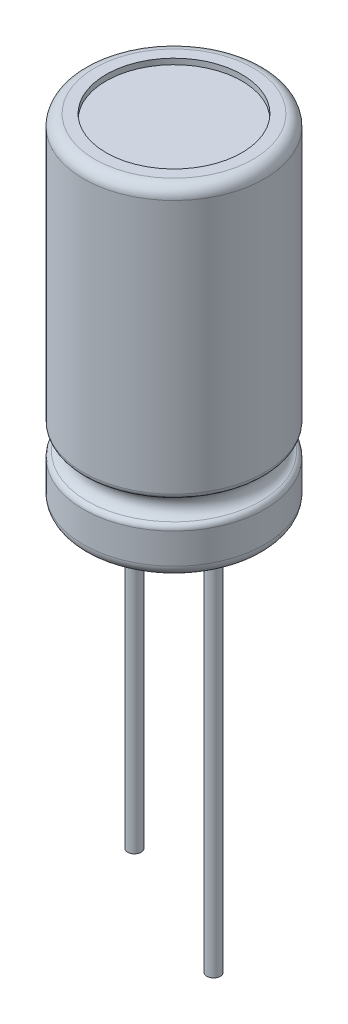
ISO-10303-21;
HEADER;
FILE_DESCRIPTION(('STEP AP214'),'2;1');
FILE_NAME('part.step','',(''),(''),'','','');
FILE_SCHEMA(('AUTOMOTIVE_DESIGN { 1 0 10303 214 1 1 1 1 }'));
ENDSEC;
DATA;
#1=APPLICATION_CONTEXT('core data for automotive mechanical design processes');
#2=APPLICATION_PROTOCOL_DEFINITION('international standard','automotive_design',2000,#1);
#3=PRODUCT_CONTEXT('',#1,'mechanical');
#4=PRODUCT('Part','Part','',(#3));
#5=PRODUCT_RELATED_PRODUCT_CATEGORY('part','',(#4));
#6=PRODUCT_DEFINITION_FORMATION('','',#4);
#7=PRODUCT_DEFINITION_CONTEXT('part definition',#1,'design');
#8=PRODUCT_DEFINITION('design','',#6,#7);
#9=PRODUCT_DEFINITION_SHAPE('','',#8);
#10=(LENGTH_UNIT() NAMED_UNIT(*) SI_UNIT(.MILLI.,.METRE.));
#11=(NAMED_UNIT(*) PLANE_ANGLE_UNIT() SI_UNIT($,.RADIAN.));
#12=(NAMED_UNIT(*) SI_UNIT($,.STERADIAN.) SOLID_ANGLE_UNIT());
#13=UNCERTAINTY_MEASURE_WITH_UNIT(LENGTH_MEASURE(1.E-05),#10,'distance_accuracy_value','');
#14=(GEOMETRIC_REPRESENTATION_CONTEXT(3) GLOBAL_UNCERTAINTY_ASSIGNED_CONTEXT((#13)) GLOBAL_UNIT_ASSIGNED_CONTEXT((#10,
#11,#12)) REPRESENTATION_CONTEXT('',''));
#15=CARTESIAN_POINT('',(0.,0.,0.));
#16=DIRECTION('',(0.,0.,1.));
#17=DIRECTION('',(1.,0.,0.));
#18=AXIS2_PLACEMENT_3D('',#15,#16,#17);
#19=CARTESIAN_POINT('',(-1.75,-17.,0.));
#20=DIRECTION('',(0.,1.,0.));
#21=DIRECTION('',(0.,0.,1.));
#22=AXIS2_PLACEMENT_3D('',#19,#20,#21);
#23=CYLINDRICAL_SURFACE('',#22,0.3);
#24=CARTESIAN_POINT('',(-1.75,0.25,0.));
#25=DIRECTION('',(0.,-1.,0.));
#26=DIRECTION('',(0.,0.,-1.));
#27=AXIS2_PLACEMENT_3D('',#24,#25,#26);
#28=CIRCLE('',#27,0.3);
#29=CARTESIAN_POINT('',(-1.75,0.25,-0.3));
#30=VERTEX_POINT('',#29);
#31=EDGE_CURVE('E65',#30,#30,#28,.T.);
#32=ORIENTED_EDGE('',*,*,#31,.T.);
#33=EDGE_LOOP('',(#32));
#34=FACE_BOUND('',#33,.T.);
#35=CARTESIAN_POINT('',(-1.75,-14.,0.));
#36=DIRECTION('',(0.,-1.,0.));
#37=DIRECTION('',(0.,0.,-1.));
#38=AXIS2_PLACEMENT_3D('',#35,#36,#37);
#39=CIRCLE('',#38,0.3);
#40=CARTESIAN_POINT('',(-1.75,-14.,-0.3));
#41=VERTEX_POINT('',#40);
#42=EDGE_CURVE('E74',#41,#41,#39,.T.);
#43=ORIENTED_EDGE('',*,*,#42,.F.);
#44=EDGE_LOOP('',(#43));
#45=FACE_BOUND('',#44,.T.);
#46=ADVANCED_FACE('F29',(#34,#45),#23,.T.);
#47=CARTESIAN_POINT('',(0.,0.25,0.));
#48=DIRECTION('',(0.,-1.,0.));
#49=DIRECTION('',(0.,0.,-1.));
#50=AXIS2_PLACEMENT_3D('',#47,#48,#49);
#51=PLANE('',#50);
#52=ORIENTED_EDGE('',*,*,#31,.F.);
#53=EDGE_LOOP('',(#52));
#54=FACE_BOUND('',#53,.T.);
#55=CARTESIAN_POINT('',(0.,0.25,0.));
#56=DIRECTION('',(0.,-1.,0.));
#57=DIRECTION('',(0.,0.,-1.));
#58=AXIS2_PLACEMENT_3D('',#55,#56,#57);
#59=CIRCLE('',#58,3.);
#60=CARTESIAN_POINT('',(0.,0.25,-3.));
#61=VERTEX_POINT('',#60);
#62=EDGE_CURVE('E61',#61,#61,#59,.T.);
#63=ORIENTED_EDGE('',*,*,#62,.T.);
#64=EDGE_LOOP('',(#63));
#65=FACE_BOUND('',#64,.T.);
#66=CARTESIAN_POINT('',(1.75,0.25,0.));
#67=DIRECTION('',(0.,-1.,0.));
#68=DIRECTION('',(0.,0.,-1.));
#69=AXIS2_PLACEMENT_3D('',#66,#67,#68);
#70=CIRCLE('',#69,0.3);
#71=CARTESIAN_POINT('',(1.75,0.25,-0.3));
#72=VERTEX_POINT('',#71);
#73=EDGE_CURVE('E71',#72,#72,#70,.T.);
#74=ORIENTED_EDGE('',*,*,#73,.F.);
#75=EDGE_LOOP('',(#74));
#76=FACE_BOUND('',#75,.T.);
#77=ADVANCED_FACE('F118',(#54,#65,#76),#51,.T.);
#78=CARTESIAN_POINT('',(0.,15.,0.));
#79=DIRECTION('',(0.,-1.,0.));
#80=DIRECTION('',(0.,0.,-1.));
#81=AXIS2_PLACEMENT_3D('',#78,#79,#80);
#82=CYLINDRICAL_SURFACE('',#81,4.);
#83=CARTESIAN_POINT('',(0.,1.84607916782785,0.));
#84=DIRECTION('',(0.,1.,0.));
#85=DIRECTION('',(0.,0.,1.));
#86=AXIS2_PLACEMENT_3D('',#83,#84,#85);
#87=CIRCLE('',#86,4.);
#88=CARTESIAN_POINT('',(0.,1.84607916782785,4.));
#89=VERTEX_POINT('',#88);
#90=EDGE_CURVE('E44',#89,#89,#87,.F.);
#91=ORIENTED_EDGE('',*,*,#90,.T.);
#92=EDGE_LOOP('',(#91));
#93=FACE_BOUND('',#92,.T.);
#94=CARTESIAN_POINT('',(0.,0.5,0.));
#95=DIRECTION('',(0.,1.,0.));
#96=DIRECTION('',(0.,0.,1.));
#97=AXIS2_PLACEMENT_3D('',#94,#95,#96);
#98=CIRCLE('',#97,4.);
#99=CARTESIAN_POINT('',(0.,0.5,4.));
#100=VERTEX_POINT('',#99);
#101=EDGE_CURVE('E58',#100,#100,#98,.T.);
#102=ORIENTED_EDGE('',*,*,#101,.T.);
#103=EDGE_LOOP('',(#102));
#104=FACE_BOUND('',#103,.T.);
#105=ADVANCED_FACE('F124',(#93,#104),#82,.T.);
#106=CARTESIAN_POINT('',(0.,0.,0.));
#107=DIRECTION('',(0.,1.,0.));
#108=DIRECTION('',(0.,0.,1.));
#109=AXIS2_PLACEMENT_3D('',#106,#107,#108);
#110=PLANE('',#109);
#111=CARTESIAN_POINT('',(0.,0.,0.));
#112=DIRECTION('',(0.,-1.,0.));
#113=DIRECTION('',(0.,0.,-1.));
#114=AXIS2_PLACEMENT_3D('',#111,#112,#113);
#115=CIRCLE('',#114,3.);
#116=CARTESIAN_POINT('',(0.,0.,-3.));
#117=VERTEX_POINT('',#116);
#118=EDGE_CURVE('E62',#117,#117,#115,.T.);
#119=ORIENTED_EDGE('',*,*,#118,.F.);
#120=EDGE_LOOP('',(#119));
#121=FACE_BOUND('',#120,.T.);
#122=CARTESIAN_POINT('',(0.,0.,0.));
#123=DIRECTION('',(0.,1.,0.));
#124=DIRECTION('',(0.,0.,1.));
#125=AXIS2_PLACEMENT_3D('',#122,#123,#124);
#126=CIRCLE('',#125,3.5);
#127=CARTESIAN_POINT('',(0.,0.,3.5));
#128=VERTEX_POINT('',#127);
#129=EDGE_CURVE('E55',#128,#128,#126,.F.);
#130=ORIENTED_EDGE('',*,*,#129,.T.);
#131=EDGE_LOOP('',(#130));
#132=FACE_BOUND('',#131,.T.);
#133=ADVANCED_FACE('F137',(#121,#132),#110,.F.);
#134=CARTESIAN_POINT('',(0.,2.5531859490144,0.));
#135=DIRECTION('',(0.,-1.,0.));
#136=DIRECTION('',(0.,0.,-1.));
#137=AXIS2_PLACEMENT_3D('',#134,#135,#136);
#138=TOROIDAL_SURFACE('',#137,4.,0.5);
#139=CARTESIAN_POINT('',(0.,2.08178142822341,0.));
#140=DIRECTION('',(0.,1.,0.));
#141=DIRECTION('',(0.,0.,1.));
#142=AXIS2_PLACEMENT_3D('',#139,#140,#141);
#143=CIRCLE('',#142,3.83333333333335);
#144=CARTESIAN_POINT('',(0.,2.08178142822341,3.83333333333335));
#145=VERTEX_POINT('',#144);
#146=EDGE_CURVE('E36',#145,#145,#143,.T.);
#147=ORIENTED_EDGE('',*,*,#146,.T.);
#148=EDGE_LOOP('',(#147));
#149=FACE_BOUND('',#148,.T.);
#150=CARTESIAN_POINT('',(0.,3.02459046980538,0.));
#151=DIRECTION('',(0.,-1.,0.));
#152=DIRECTION('',(0.,0.,-1.));
#153=AXIS2_PLACEMENT_3D('',#150,#151,#152);
#154=CIRCLE('',#153,3.83333333333335);
#155=CARTESIAN_POINT('',(0.,3.02459046980538,-3.83333333333335));
#156=VERTEX_POINT('',#155);
#157=EDGE_CURVE('E40',#156,#156,#154,.T.);
#158=ORIENTED_EDGE('',*,*,#157,.T.);
#159=EDGE_LOOP('',(#158));
#160=FACE_BOUND('',#159,.T.);
#161=ADVANCED_FACE('F99',(#149,#160),#138,.F.);
#162=CARTESIAN_POINT('',(0.,15.,0.));
#163=DIRECTION('',(0.,1.,0.));
#164=DIRECTION('',(0.,0.,1.));
#165=AXIS2_PLACEMENT_3D('',#162,#163,#164);
#166=PLANE('',#165);
#167=CARTESIAN_POINT('',(0.,15.,0.));
#168=DIRECTION('',(0.,1.,0.));
#169=DIRECTION('',(0.,0.,1.));
#170=AXIS2_PLACEMENT_3D('',#167,#168,#169);
#171=CIRCLE('',#170,3.);
#172=CARTESIAN_POINT('',(0.,15.,3.));
#173=VERTEX_POINT('',#172);
#174=EDGE_CURVE('E80',#173,#173,#171,.T.);
#175=ORIENTED_EDGE('',*,*,#174,.F.);
#176=EDGE_LOOP('',(#175));
#177=FACE_BOUND('',#176,.T.);
#178=CARTESIAN_POINT('',(0.,15.,0.));
#179=DIRECTION('',(0.,1.,0.));
#180=DIRECTION('',(0.,0.,1.));
#181=AXIS2_PLACEMENT_3D('',#178,#179,#180);
#182=CIRCLE('',#181,3.5);
#183=CARTESIAN_POINT('',(0.,15.,3.5));
#184=VERTEX_POINT('',#183);
#185=EDGE_CURVE('E52',#184,#184,#182,.T.);
#186=ORIENTED_EDGE('',*,*,#185,.T.);
#187=EDGE_LOOP('',(#186));
#188=FACE_BOUND('',#187,.T.);
#189=ADVANCED_FACE('F95',(#177,#188),#166,.T.);
#190=CARTESIAN_POINT('',(0.,3.26029273020095,0.));
#191=DIRECTION('',(0.,1.,0.));
#192=DIRECTION('',(0.,0.,1.));
#193=AXIS2_PLACEMENT_3D('',#190,#191,#192);
#194=CIRCLE('',#193,4.);
#195=CARTESIAN_POINT('',(0.,3.26029273020095,4.));
#196=VERTEX_POINT('',#195);
#197=EDGE_CURVE('E10',#196,#196,#194,.T.);
#198=ORIENTED_EDGE('',*,*,#197,.T.);
#199=EDGE_LOOP('',(#198));
#200=FACE_BOUND('',#199,.T.);
#201=CARTESIAN_POINT('',(0.,14.5,0.));
#202=DIRECTION('',(0.,1.,0.));
#203=DIRECTION('',(0.,0.,1.));
#204=AXIS2_PLACEMENT_3D('',#201,#202,#203);
#205=CIRCLE('',#204,4.);
#206=CARTESIAN_POINT('',(0.,14.5,4.));
#207=VERTEX_POINT('',#206);
#208=EDGE_CURVE('E49',#207,#207,#205,.F.);
#209=ORIENTED_EDGE('',*,*,#208,.T.);
#210=EDGE_LOOP('',(#209));
#211=FACE_BOUND('',#210,.T.);
#212=ADVANCED_FACE('F98',(#200,#211),#82,.T.);
#213=CARTESIAN_POINT('',(0.,0.5,0.));
#214=DIRECTION('',(0.,1.,0.));
#215=DIRECTION('',(0.,0.,1.));
#216=AXIS2_PLACEMENT_3D('',#213,#214,#215);
#217=TOROIDAL_SURFACE('',#216,3.5,0.5);
#218=ORIENTED_EDGE('',*,*,#129,.F.);
#219=EDGE_LOOP('',(#218));
#220=FACE_BOUND('',#219,.T.);
#221=ORIENTED_EDGE('',*,*,#101,.F.);
#222=EDGE_LOOP('',(#221));
#223=FACE_BOUND('',#222,.T.);
#224=ADVANCED_FACE('F106',(#220,#223),#217,.T.);
#225=CARTESIAN_POINT('',(0.,14.5,0.));
#226=DIRECTION('',(0.,1.,0.));
#227=DIRECTION('',(0.,0.,1.));
#228=AXIS2_PLACEMENT_3D('',#225,#226,#227);
#229=TOROIDAL_SURFACE('',#228,3.5,0.5);
#230=ORIENTED_EDGE('',*,*,#208,.F.);
#231=EDGE_LOOP('',(#230));
#232=FACE_BOUND('',#231,.T.);
#233=ORIENTED_EDGE('',*,*,#185,.F.);
#234=EDGE_LOOP('',(#233));
#235=FACE_BOUND('',#234,.T.);
#236=ADVANCED_FACE('F103',(#232,#235),#229,.T.);
#237=CARTESIAN_POINT('',(0.,1.84607916782785,0.));
#238=DIRECTION('',(0.,1.,0.));
#239=DIRECTION('',(0.,0.,1.));
#240=AXIS2_PLACEMENT_3D('',#237,#238,#239);
#241=TOROIDAL_SURFACE('',#240,3.75,0.25);
#242=ORIENTED_EDGE('',*,*,#146,.F.);
#243=EDGE_LOOP('',(#242));
#244=FACE_BOUND('',#243,.T.);
#245=ORIENTED_EDGE('',*,*,#90,.F.);
#246=EDGE_LOOP('',(#245));
#247=FACE_BOUND('',#246,.T.);
#248=ADVANCED_FACE('F105',(#244,#247),#241,.T.);
#249=CARTESIAN_POINT('',(0.,3.26029273020095,0.));
#250=DIRECTION('',(0.,1.,0.));
#251=DIRECTION('',(0.,0.,1.));
#252=AXIS2_PLACEMENT_3D('',#249,#250,#251);
#253=TOROIDAL_SURFACE('',#252,3.75,0.25);
#254=ORIENTED_EDGE('',*,*,#197,.F.);
#255=EDGE_LOOP('',(#254));
#256=FACE_BOUND('',#255,.T.);
#257=ORIENTED_EDGE('',*,*,#157,.F.);
#258=EDGE_LOOP('',(#257));
#259=FACE_BOUND('',#258,.T.);
#260=ADVANCED_FACE('F31',(#256,#259),#253,.T.);
#261=CARTESIAN_POINT('',(0.,0.25,0.));
#262=DIRECTION('',(0.,-1.,0.));
#263=DIRECTION('',(0.,0.,-1.));
#264=AXIS2_PLACEMENT_3D('',#261,#262,#263);
#265=CYLINDRICAL_SURFACE('',#264,3.);
#266=ORIENTED_EDGE('',*,*,#62,.F.);
#267=EDGE_LOOP('',(#266));
#268=FACE_BOUND('',#267,.T.);
#269=ORIENTED_EDGE('',*,*,#118,.T.);
#270=EDGE_LOOP('',(#269));
#271=FACE_BOUND('',#270,.T.);
#272=ADVANCED_FACE('F132',(#268,#271),#265,.F.);
#273=CARTESIAN_POINT('',(1.75,-17.,0.));
#274=DIRECTION('',(0.,1.,0.));
#275=DIRECTION('',(0.,0.,1.));
#276=AXIS2_PLACEMENT_3D('',#273,#274,#275);
#277=CYLINDRICAL_SURFACE('',#276,0.3);
#278=CARTESIAN_POINT('',(1.75,-17.,0.));
#279=DIRECTION('',(0.,-1.,0.));
#280=DIRECTION('',(0.,0.,-1.));
#281=AXIS2_PLACEMENT_3D('',#278,#279,#280);
#282=CIRCLE('',#281,0.3);
#283=CARTESIAN_POINT('',(1.75,-17.,-0.3));
#284=VERTEX_POINT('',#283);
#285=EDGE_CURVE('E70',#284,#284,#282,.T.);
#286=ORIENTED_EDGE('',*,*,#285,.F.);
#287=EDGE_LOOP('',(#286));
#288=FACE_BOUND('',#287,.T.);
#289=ORIENTED_EDGE('',*,*,#73,.T.);
#290=EDGE_LOOP('',(#289));
#291=FACE_BOUND('',#290,.T.);
#292=ADVANCED_FACE('F129',(#288,#291),#277,.T.);
#293=CARTESIAN_POINT('',(1.75,-17.,0.));
#294=DIRECTION('',(0.,-1.,0.));
#295=DIRECTION('',(0.,0.,-1.));
#296=AXIS2_PLACEMENT_3D('',#293,#294,#295);
#297=PLANE('',#296);
#298=ORIENTED_EDGE('',*,*,#285,.T.);
#299=EDGE_LOOP('',(#298));
#300=FACE_BOUND('',#299,.T.);
#301=ADVANCED_FACE('F205',(#300),#297,.T.);
#302=CARTESIAN_POINT('',(-1.75,-14.,0.));
#303=DIRECTION('',(0.,-1.,0.));
#304=DIRECTION('',(0.,0.,-1.));
#305=AXIS2_PLACEMENT_3D('',#302,#303,#304);
#306=PLANE('',#305);
#307=ORIENTED_EDGE('',*,*,#42,.T.);
#308=EDGE_LOOP('',(#307));
#309=FACE_BOUND('',#308,.T.);
#310=ADVANCED_FACE('F91',(#309),#306,.T.);
#311=CARTESIAN_POINT('',(0.,14.75,0.));
#312=DIRECTION('',(0.,1.,0.));
#313=DIRECTION('',(0.,0.,1.));
#314=AXIS2_PLACEMENT_3D('',#311,#312,#313);
#315=CYLINDRICAL_SURFACE('',#314,3.);
#316=CARTESIAN_POINT('',(0.,14.75,0.));
#317=DIRECTION('',(0.,1.,0.));
#318=DIRECTION('',(0.,0.,1.));
#319=AXIS2_PLACEMENT_3D('',#316,#317,#318);
#320=CIRCLE('',#319,3.);
#321=CARTESIAN_POINT('',(0.,14.75,3.));
#322=VERTEX_POINT('',#321);
#323=EDGE_CURVE('E79',#322,#322,#320,.T.);
#324=ORIENTED_EDGE('',*,*,#323,.F.);
#325=EDGE_LOOP('',(#324));
#326=FACE_BOUND('',#325,.T.);
#327=ORIENTED_EDGE('',*,*,#174,.T.);
#328=EDGE_LOOP('',(#327));
#329=FACE_BOUND('',#328,.T.);
#330=ADVANCED_FACE('F88',(#326,#329),#315,.F.);
#331=CARTESIAN_POINT('',(0.,14.75,0.));
#332=DIRECTION('',(0.,1.,0.));
#333=DIRECTION('',(0.,0.,1.));
#334=AXIS2_PLACEMENT_3D('',#331,#332,#333);
#335=PLANE('',#334);
#336=ORIENTED_EDGE('',*,*,#323,.T.);
#337=EDGE_LOOP('',(#336));
#338=FACE_BOUND('',#337,.T.);
#339=ADVANCED_FACE('F86',(#338),#335,.T.);
#340=CLOSED_SHELL('',(#46,#77,#105,#133,#161,#189,#212,#224,#236,#248,#260,#272,#292,#301,#310,
#330,#339));
#341=MANIFOLD_SOLID_BREP('B2',#340);
#342=ADVANCED_BREP_SHAPE_REPRESENTATION('',(#18,#341),#14);
#343=SHAPE_DEFINITION_REPRESENTATION(#9,#342);
ENDSEC;
END-ISO-10303-21;
